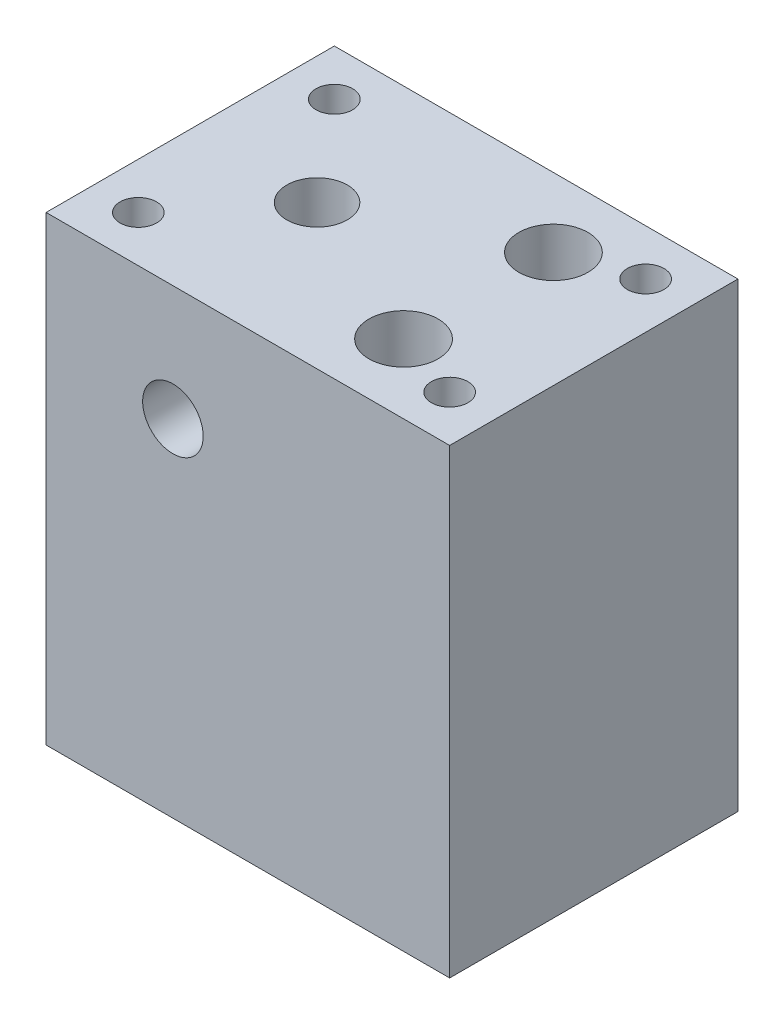
ISO-10303-21;
HEADER;
FILE_DESCRIPTION(('STEP AP214'),'2;1');
FILE_NAME('part.step','',(''),(''),'','','');
FILE_SCHEMA(('AUTOMOTIVE_DESIGN { 1 0 10303 214 1 1 1 1 }'));
ENDSEC;
DATA;
#1=APPLICATION_CONTEXT('core data for automotive mechanical design processes');
#2=APPLICATION_PROTOCOL_DEFINITION('international standard','automotive_design',2000,#1);
#3=PRODUCT_CONTEXT('',#1,'mechanical');
#4=PRODUCT('Part','Part','',(#3));
#5=PRODUCT_RELATED_PRODUCT_CATEGORY('part','',(#4));
#6=PRODUCT_DEFINITION_FORMATION('','',#4);
#7=PRODUCT_DEFINITION_CONTEXT('part definition',#1,'design');
#8=PRODUCT_DEFINITION('design','',#6,#7);
#9=PRODUCT_DEFINITION_SHAPE('','',#8);
#10=(LENGTH_UNIT() NAMED_UNIT(*) SI_UNIT(.MILLI.,.METRE.));
#11=(NAMED_UNIT(*) PLANE_ANGLE_UNIT() SI_UNIT($,.RADIAN.));
#12=(NAMED_UNIT(*) SI_UNIT($,.STERADIAN.) SOLID_ANGLE_UNIT());
#13=UNCERTAINTY_MEASURE_WITH_UNIT(LENGTH_MEASURE(1.E-05),#10,'distance_accuracy_value','');
#14=(GEOMETRIC_REPRESENTATION_CONTEXT(3) GLOBAL_UNCERTAINTY_ASSIGNED_CONTEXT((#13)) GLOBAL_UNIT_ASSIGNED_CONTEXT((#10,
#11,#12)) REPRESENTATION_CONTEXT('',''));
#15=CARTESIAN_POINT('',(0.,0.,0.));
#16=DIRECTION('',(0.,0.,1.));
#17=DIRECTION('',(1.,0.,0.));
#18=AXIS2_PLACEMENT_3D('',#15,#16,#17);
#19=CARTESIAN_POINT('',(0.,40.,0.));
#20=DIRECTION('',(1.,0.,0.));
#21=DIRECTION('',(0.,0.,-1.));
#22=AXIS2_PLACEMENT_3D('',#19,#20,#21);
#23=PLANE('',#22);
#24=DIRECTION('',(0.,0.,1.));
#25=VECTOR('',#24,1.);
#26=CARTESIAN_POINT('',(0.,0.,0.));
#27=LINE('',#26,#25);
#28=CARTESIAN_POINT('',(0.,0.,-25.));
#29=VERTEX_POINT('',#28);
#30=CARTESIAN_POINT('',(0.,0.,0.));
#31=VERTEX_POINT('',#30);
#32=EDGE_CURVE('E106',#29,#31,#27,.T.);
#33=ORIENTED_EDGE('',*,*,#32,.T.);
#34=DIRECTION('',(0.,-1.,0.));
#35=VECTOR('',#34,1.);
#36=CARTESIAN_POINT('',(0.,40.,0.));
#37=LINE('',#36,#35);
#38=CARTESIAN_POINT('',(0.,40.,0.));
#39=VERTEX_POINT('',#38);
#40=EDGE_CURVE('E87',#39,#31,#37,.T.);
#41=ORIENTED_EDGE('',*,*,#40,.F.);
#42=DIRECTION('',(0.,0.,1.));
#43=VECTOR('',#42,1.);
#44=CARTESIAN_POINT('',(0.,40.,0.));
#45=LINE('',#44,#43);
#46=CARTESIAN_POINT('',(0.,40.,-25.));
#47=VERTEX_POINT('',#46);
#48=EDGE_CURVE('E94',#47,#39,#45,.T.);
#49=ORIENTED_EDGE('',*,*,#48,.F.);
#50=DIRECTION('',(0.,-1.,0.));
#51=VECTOR('',#50,1.);
#52=CARTESIAN_POINT('',(0.,40.,-25.));
#53=LINE('',#52,#51);
#54=EDGE_CURVE('E219',#47,#29,#53,.T.);
#55=ORIENTED_EDGE('',*,*,#54,.T.);
#56=EDGE_LOOP('',(#33,#41,#49,#55));
#57=FACE_BOUND('',#56,.T.);
#58=ADVANCED_FACE('F37',(#57),#23,.F.);
#59=CARTESIAN_POINT('',(0.,40.,0.));
#60=DIRECTION('',(0.,0.,-1.));
#61=DIRECTION('',(-1.,0.,0.));
#62=AXIS2_PLACEMENT_3D('',#59,#60,#61);
#63=PLANE('',#62);
#64=CARTESIAN_POINT('',(11.,30.,0.));
#65=DIRECTION('',(0.,0.,1.));
#66=DIRECTION('',(1.,0.,0.));
#67=AXIS2_PLACEMENT_3D('',#64,#65,#66);
#68=CIRCLE('',#67,2.625);
#69=CARTESIAN_POINT('',(13.625,30.,0.));
#70=VERTEX_POINT('',#69);
#71=EDGE_CURVE('E121',#70,#70,#68,.T.);
#72=ORIENTED_EDGE('',*,*,#71,.F.);
#73=EDGE_LOOP('',(#72));
#74=FACE_BOUND('',#73,.T.);
#75=DIRECTION('',(1.,0.,0.));
#76=VECTOR('',#75,1.);
#77=CARTESIAN_POINT('',(0.,0.,0.));
#78=LINE('',#77,#76);
#79=CARTESIAN_POINT('',(35.,0.,0.));
#80=VERTEX_POINT('',#79);
#81=EDGE_CURVE('E221',#31,#80,#78,.T.);
#82=ORIENTED_EDGE('',*,*,#81,.T.);
#83=DIRECTION('',(0.,-1.,0.));
#84=VECTOR('',#83,1.);
#85=CARTESIAN_POINT('',(35.,40.,0.));
#86=LINE('',#85,#84);
#87=CARTESIAN_POINT('',(35.,40.,0.));
#88=VERTEX_POINT('',#87);
#89=EDGE_CURVE('E90',#88,#80,#86,.T.);
#90=ORIENTED_EDGE('',*,*,#89,.F.);
#91=DIRECTION('',(1.,0.,0.));
#92=VECTOR('',#91,1.);
#93=CARTESIAN_POINT('',(0.,40.,0.));
#94=LINE('',#93,#92);
#95=EDGE_CURVE('E83',#39,#88,#94,.T.);
#96=ORIENTED_EDGE('',*,*,#95,.F.);
#97=ORIENTED_EDGE('',*,*,#40,.T.);
#98=EDGE_LOOP('',(#82,#90,#96,#97));
#99=FACE_BOUND('',#98,.T.);
#100=ADVANCED_FACE('F85',(#74,#99),#63,.F.);
#101=CARTESIAN_POINT('',(35.,40.,0.));
#102=DIRECTION('',(-1.,0.,0.));
#103=DIRECTION('',(0.,0.,1.));
#104=AXIS2_PLACEMENT_3D('',#101,#102,#103);
#105=PLANE('',#104);
#106=DIRECTION('',(0.,0.,-1.));
#107=VECTOR('',#106,1.);
#108=CARTESIAN_POINT('',(35.,0.,0.));
#109=LINE('',#108,#107);
#110=CARTESIAN_POINT('',(35.,0.,-25.));
#111=VERTEX_POINT('',#110);
#112=EDGE_CURVE('E223',#80,#111,#109,.T.);
#113=ORIENTED_EDGE('',*,*,#112,.T.);
#114=DIRECTION('',(0.,-1.,0.));
#115=VECTOR('',#114,1.);
#116=CARTESIAN_POINT('',(35.,40.,-25.));
#117=LINE('',#116,#115);
#118=CARTESIAN_POINT('',(35.,40.,-25.));
#119=VERTEX_POINT('',#118);
#120=EDGE_CURVE('E110',#119,#111,#117,.T.);
#121=ORIENTED_EDGE('',*,*,#120,.F.);
#122=DIRECTION('',(0.,0.,-1.));
#123=VECTOR('',#122,1.);
#124=CARTESIAN_POINT('',(35.,40.,0.));
#125=LINE('',#124,#123);
#126=EDGE_CURVE('E93',#88,#119,#125,.T.);
#127=ORIENTED_EDGE('',*,*,#126,.F.);
#128=ORIENTED_EDGE('',*,*,#89,.T.);
#129=EDGE_LOOP('',(#113,#121,#127,#128));
#130=FACE_BOUND('',#129,.T.);
#131=ADVANCED_FACE('F163',(#130),#105,.F.);
#132=CARTESIAN_POINT('',(0.,40.,-25.));
#133=DIRECTION('',(0.,0.,1.));
#134=DIRECTION('',(1.,0.,0.));
#135=AXIS2_PLACEMENT_3D('',#132,#133,#134);
#136=PLANE('',#135);
#137=DIRECTION('',(-1.,0.,0.));
#138=VECTOR('',#137,1.);
#139=CARTESIAN_POINT('',(0.,0.,-25.));
#140=LINE('',#139,#138);
#141=EDGE_CURVE('E103',#111,#29,#140,.T.);
#142=ORIENTED_EDGE('',*,*,#141,.T.);
#143=ORIENTED_EDGE('',*,*,#54,.F.);
#144=DIRECTION('',(-1.,0.,0.));
#145=VECTOR('',#144,1.);
#146=CARTESIAN_POINT('',(0.,40.,-25.));
#147=LINE('',#146,#145);
#148=EDGE_CURVE('E99',#119,#47,#147,.T.);
#149=ORIENTED_EDGE('',*,*,#148,.F.);
#150=ORIENTED_EDGE('',*,*,#120,.T.);
#151=EDGE_LOOP('',(#142,#143,#149,#150));
#152=FACE_BOUND('',#151,.T.);
#153=ADVANCED_FACE('F169',(#152),#136,.F.);
#154=CARTESIAN_POINT('',(0.,40.,0.));
#155=DIRECTION('',(0.,-1.,0.));
#156=DIRECTION('',(0.,0.,-1.));
#157=AXIS2_PLACEMENT_3D('',#154,#155,#156);
#158=PLANE('',#157);
#159=CARTESIAN_POINT('',(11.,40.,-12.5));
#160=DIRECTION('',(0.,-1.,0.));
#161=DIRECTION('',(0.,0.,-1.));
#162=AXIS2_PLACEMENT_3D('',#159,#160,#161);
#163=CIRCLE('',#162,2.625);
#164=CARTESIAN_POINT('',(11.,40.,-15.125));
#165=VERTEX_POINT('',#164);
#166=EDGE_CURVE('E183',#165,#165,#163,.T.);
#167=ORIENTED_EDGE('',*,*,#166,.T.);
#168=EDGE_LOOP('',(#167));
#169=FACE_BOUND('',#168,.T.);
#170=CARTESIAN_POINT('',(4.,40.,-21.));
#171=DIRECTION('',(0.,1.,0.));
#172=DIRECTION('',(0.,0.,-1.));
#173=AXIS2_PLACEMENT_3D('',#170,#171,#172);
#174=CIRCLE('',#173,1.5875);
#175=CARTESIAN_POINT('',(4.,40.,-22.5875));
#176=VERTEX_POINT('',#175);
#177=EDGE_CURVE('E187',#176,#176,#174,.T.);
#178=ORIENTED_EDGE('',*,*,#177,.F.);
#179=EDGE_LOOP('',(#178));
#180=FACE_BOUND('',#179,.T.);
#181=CARTESIAN_POINT('',(31.,40.,-4.));
#182=DIRECTION('',(0.,1.,0.));
#183=DIRECTION('',(0.,0.,-1.));
#184=AXIS2_PLACEMENT_3D('',#181,#182,#183);
#185=CIRCLE('',#184,1.5875);
#186=CARTESIAN_POINT('',(31.,40.,-5.5875));
#187=VERTEX_POINT('',#186);
#188=EDGE_CURVE('E191',#187,#187,#185,.T.);
#189=ORIENTED_EDGE('',*,*,#188,.F.);
#190=EDGE_LOOP('',(#189));
#191=FACE_BOUND('',#190,.T.);
#192=CARTESIAN_POINT('',(31.,40.,-21.));
#193=DIRECTION('',(0.,1.,0.));
#194=DIRECTION('',(0.,0.,1.));
#195=AXIS2_PLACEMENT_3D('',#192,#193,#194);
#196=CIRCLE('',#195,1.5875);
#197=CARTESIAN_POINT('',(31.,40.,-19.4125));
#198=VERTEX_POINT('',#197);
#199=EDGE_CURVE('E195',#198,#198,#196,.T.);
#200=ORIENTED_EDGE('',*,*,#199,.F.);
#201=EDGE_LOOP('',(#200));
#202=FACE_BOUND('',#201,.T.);
#203=CARTESIAN_POINT('',(4.,40.,-4.));
#204=DIRECTION('',(0.,1.,0.));
#205=DIRECTION('',(0.,0.,1.));
#206=AXIS2_PLACEMENT_3D('',#203,#204,#205);
#207=CIRCLE('',#206,1.5875);
#208=CARTESIAN_POINT('',(4.,40.,-2.4125));
#209=VERTEX_POINT('',#208);
#210=EDGE_CURVE('E199',#209,#209,#207,.T.);
#211=ORIENTED_EDGE('',*,*,#210,.F.);
#212=EDGE_LOOP('',(#211));
#213=FACE_BOUND('',#212,.T.);
#214=CARTESIAN_POINT('',(25.,40.,-19.));
#215=DIRECTION('',(0.,1.,0.));
#216=DIRECTION('',(0.,0.,1.));
#217=AXIS2_PLACEMENT_3D('',#214,#215,#216);
#218=CIRCLE('',#217,2.99999999999999);
#219=CARTESIAN_POINT('',(25.,40.,-16.));
#220=VERTEX_POINT('',#219);
#221=EDGE_CURVE('E120',#220,#220,#218,.T.);
#222=ORIENTED_EDGE('',*,*,#221,.F.);
#223=EDGE_LOOP('',(#222));
#224=FACE_BOUND('',#223,.T.);
#225=CARTESIAN_POINT('',(25.,40.,-6.));
#226=DIRECTION('',(0.,-1.,0.));
#227=DIRECTION('',(0.,0.,-1.));
#228=AXIS2_PLACEMENT_3D('',#225,#226,#227);
#229=CIRCLE('',#228,2.99999999999999);
#230=CARTESIAN_POINT('',(25.,40.,-8.99999999999999));
#231=VERTEX_POINT('',#230);
#232=EDGE_CURVE('E205',#231,#231,#229,.T.);
#233=ORIENTED_EDGE('',*,*,#232,.T.);
#234=EDGE_LOOP('',(#233));
#235=FACE_BOUND('',#234,.T.);
#236=ORIENTED_EDGE('',*,*,#48,.T.);
#237=ORIENTED_EDGE('',*,*,#95,.T.);
#238=ORIENTED_EDGE('',*,*,#126,.T.);
#239=ORIENTED_EDGE('',*,*,#148,.T.);
#240=EDGE_LOOP('',(#236,#237,#238,#239));
#241=FACE_BOUND('',#240,.T.);
#242=ADVANCED_FACE('F97',(#169,#180,#191,#202,#213,#224,#235,#241),#158,.F.);
#243=CARTESIAN_POINT('',(0.,0.,0.));
#244=DIRECTION('',(0.,-1.,0.));
#245=DIRECTION('',(0.,0.,-1.));
#246=AXIS2_PLACEMENT_3D('',#243,#244,#245);
#247=PLANE('',#246);
#248=CARTESIAN_POINT('',(11.,0.,-12.5));
#249=DIRECTION('',(0.,1.,0.));
#250=DIRECTION('',(0.,0.,1.));
#251=AXIS2_PLACEMENT_3D('',#248,#249,#250);
#252=CIRCLE('',#251,5.5);
#253=CARTESIAN_POINT('',(11.,0.,-7.));
#254=VERTEX_POINT('',#253);
#255=EDGE_CURVE('E209',#254,#254,#252,.T.);
#256=ORIENTED_EDGE('',*,*,#255,.T.);
#257=EDGE_LOOP('',(#256));
#258=FACE_BOUND('',#257,.T.);
#259=ORIENTED_EDGE('',*,*,#32,.F.);
#260=ORIENTED_EDGE('',*,*,#141,.F.);
#261=ORIENTED_EDGE('',*,*,#112,.F.);
#262=ORIENTED_EDGE('',*,*,#81,.F.);
#263=EDGE_LOOP('',(#259,#260,#261,#262));
#264=FACE_BOUND('',#263,.T.);
#265=ADVANCED_FACE('F155',(#258,#264),#247,.T.);
#266=CARTESIAN_POINT('',(11.,35.,-12.5));
#267=DIRECTION('',(0.,-1.,0.));
#268=DIRECTION('',(0.,0.,-1.));
#269=AXIS2_PLACEMENT_3D('',#266,#267,#268);
#270=CYLINDRICAL_SURFACE('',#269,5.5);
#271=CARTESIAN_POINT('',(13.625,30.,-7.6668462677047));
#272=CARTESIAN_POINT('',(13.6249901282648,29.8622779116695,-7.66683479677179));
#273=CARTESIAN_POINT('',(13.6140896786244,29.7243557847855,-7.66087117184379));
#274=CARTESIAN_POINT('',(13.571005990129,29.4526720082657,-7.63785145158561));
#275=CARTESIAN_POINT('',(13.5387740456933,29.3189206150779,-7.62076997266221));
#276=CARTESIAN_POINT('',(13.4546845844008,29.0600083325892,-7.57793566493952));
#277=CARTESIAN_POINT('',(13.4029241854982,28.9348084959442,-7.55222581511403));
#278=CARTESIAN_POINT('',(13.281541431072,28.6948999848225,-7.495097063231));
#279=CARTESIAN_POINT('',(13.2119195297233,28.5801910436881,-7.46367830634313));
#280=CARTESIAN_POINT('',(13.0506750069265,28.355027237704,-7.39579283601655));
#281=CARTESIAN_POINT('',(12.9577963415563,28.2455322446542,-7.35912432681001));
#282=CARTESIAN_POINT('',(12.7552942482689,28.0429373054358,-7.28650663048745));
#283=CARTESIAN_POINT('',(12.6456631182662,27.9498449431179,-7.25055778288424));
#284=CARTESIAN_POINT('',(12.4047067226166,27.7772384284651,-7.18084276528552));
#285=CARTESIAN_POINT('',(12.2724737579157,27.6988761998155,-7.14733752274563));
#286=CARTESIAN_POINT('',(11.9948054037284,27.565942151493,-7.08885993056047));
#287=CARTESIAN_POINT('',(11.8493776810145,27.5113566220602,-7.06388266544304));
#288=CARTESIAN_POINT('',(11.5595926660669,27.4312322541903,-7.02672224843766));
#289=CARTESIAN_POINT('',(11.4157946859647,27.404018362084,-7.01380533554801));
#290=CARTESIAN_POINT('',(11.1251360814438,27.3739232376379,-6.99950298994396));
#291=CARTESIAN_POINT('',(10.9782771684988,27.3710287549441,-6.99811127776598));
#292=CARTESIAN_POINT('',(10.6981367434017,27.3889404588574,-7.00664341578106));
#293=CARTESIAN_POINT('',(10.5647031049453,27.4078828983346,-7.01567750691494));
#294=CARTESIAN_POINT('',(10.3031771170397,27.4656363585988,-7.04273646497911));
#295=CARTESIAN_POINT('',(10.1750851657206,27.5044488575017,-7.0607620007723));
#296=CARTESIAN_POINT('',(9.92555403788537,27.60117348318,-7.10445916200192));
#297=CARTESIAN_POINT('',(9.80423981708616,27.6593570914555,-7.13023893475351));
#298=CARTESIAN_POINT('',(9.57278861845472,27.7928390226434,-7.18706383148426));
#299=CARTESIAN_POINT('',(9.46265574705294,27.8681436006999,-7.21811087880672));
#300=CARTESIAN_POINT('',(9.24635212122785,28.0413787501465,-7.2857249621281));
#301=CARTESIAN_POINT('',(9.14138519784886,28.1407181708223,-7.32253733397194));
#302=CARTESIAN_POINT('',(8.94898474218536,28.3553850248951,-7.39569273856378));
#303=CARTESIAN_POINT('',(8.86156263524211,28.4707227944281,-7.43203545114799));
#304=CARTESIAN_POINT('',(8.70216431099405,28.7217799580985,-7.50220558694354));
#305=CARTESIAN_POINT('',(8.63127417798528,28.8582627042986,-7.53579196374088));
#306=CARTESIAN_POINT('',(8.5139924241775,29.1432219133188,-7.59346522916457));
#307=CARTESIAN_POINT('',(8.46757727493871,29.2916866985565,-7.61756123546969));
#308=CARTESIAN_POINT('',(8.40412412335123,29.5843935048764,-7.65101754774467));
#309=CARTESIAN_POINT('',(8.38511244934565,29.7280914121564,-7.66136310357726));
#310=CARTESIAN_POINT('',(8.37108130783224,30.0169652195578,-7.66896802592995));
#311=CARTESIAN_POINT('',(8.37604803970468,30.1621402215426,-7.66623491979914));
#312=CARTESIAN_POINT('',(8.4080221869395,30.4351523232109,-7.64903025989778));
#313=CARTESIAN_POINT('',(8.43288489340792,30.5633236263371,-7.63570173503128));
#314=CARTESIAN_POINT('',(8.50086150719932,30.8134750051585,-7.60043251030987));
#315=CARTESIAN_POINT('',(8.54398072907285,30.9354532664438,-7.57848930281906));
#316=CARTESIAN_POINT('',(8.64938753930454,31.1761403551567,-7.52725495122093));
#317=CARTESIAN_POINT('',(8.71247021956767,31.2944362946748,-7.49767062630001));
#318=CARTESIAN_POINT('',(8.85529644497713,31.5194236303392,-7.43479205536135));
#319=CARTESIAN_POINT('',(8.93504836180092,31.6261091543682,-7.40149594913687));
#320=CARTESIAN_POINT('',(9.11948154049399,31.8374133209798,-7.3304286147309));
#321=CARTESIAN_POINT('',(9.22595954628727,31.9404433850348,-7.29257601310726));
#322=CARTESIAN_POINT('',(9.45539128637085,32.1276111505145,-7.21997588420257));
#323=CARTESIAN_POINT('',(9.57834908219741,32.2117441809385,-7.18522912590414));
#324=CARTESIAN_POINT('',(9.84046103969172,32.3599038137956,-7.12190111508204));
#325=CARTESIAN_POINT('',(9.97986752897487,32.4235399994732,-7.09344249776267));
#326=CARTESIAN_POINT('',(10.2691506729018,32.5258602485318,-7.04681243829902));
#327=CARTESIAN_POINT('',(10.4190188540988,32.564564251694,-7.02863277687567));
#328=CARTESIAN_POINT('',(10.7110183004157,32.6128714249388,-7.0058150394812));
#329=CARTESIAN_POINT('',(10.852702668803,32.624695786954,-7.0001446281356));
#330=CARTESIAN_POINT('',(11.1361117889416,32.6252922980903,-6.99986105837891));
#331=CARTESIAN_POINT('',(11.2778365170112,32.6140711416984,-7.00524468888184));
#332=CARTESIAN_POINT('',(11.5489157325919,32.570429012824,-7.02586571967684));
#333=CARTESIAN_POINT('',(11.6785167482823,32.5392414635268,-7.04052928323239));
#334=CARTESIAN_POINT('',(11.9304832201053,32.4581197506355,-7.07778338867266));
#335=CARTESIAN_POINT('',(12.0528475416986,32.408182656535,-7.10037516968162));
#336=CARTESIAN_POINT('',(12.2929818191173,32.2885842806935,-7.15266645067618));
#337=CARTESIAN_POINT('',(12.4103005805975,32.2181398000291,-7.18263896088022));
#338=CARTESIAN_POINT('',(12.6319599237734,32.0605458676548,-7.24642678305868));
#339=CARTESIAN_POINT('',(12.7362945398904,31.9733887837066,-7.28024384786374));
#340=CARTESIAN_POINT('',(12.939032371559,31.7755608131869,-7.35191837574941));
#341=CARTESIAN_POINT('',(13.0360242921209,31.6634696135011,-7.38986283374461));
#342=CARTESIAN_POINT('',(13.2102505610795,31.4238674135965,-7.46276559046532));
#343=CARTESIAN_POINT('',(13.2874699286481,31.2963448287542,-7.49772161170037));
#344=CARTESIAN_POINT('',(13.4210044793948,31.0258897864398,-7.56093680679066));
#345=CARTESIAN_POINT('',(13.476900923225,30.882713387498,-7.5890582471738));
#346=CARTESIAN_POINT('',(13.5414772820211,30.6613909858433,-7.62235105552975));
#347=CARTESIAN_POINT('',(13.5597833443354,30.5865956618292,-7.6319623340338));
#348=CARTESIAN_POINT('',(13.5897896913013,30.4353620537801,-7.64785775270632));
#349=CARTESIAN_POINT('',(13.6014947386442,30.3589249957136,-7.65414429150004));
#350=CARTESIAN_POINT('',(13.6148602830449,30.2352589113207,-7.66134970459871));
#351=CARTESIAN_POINT('',(13.6186592752142,30.1883145520611,-7.66340652461958));
#352=CARTESIAN_POINT('',(13.6237308922018,30.0942546130649,-7.66615680656608));
#353=CARTESIAN_POINT('',(13.6250033788622,30.0471390241059,-7.66685019393462));
#354=CARTESIAN_POINT('',(13.625,30.,-7.6668462677047));
#355=B_SPLINE_CURVE_WITH_KNOTS('',3,(#271,#272,#273,#274,#275,#276,#277,#278,#279,#280,#281,
#282,#283,#284,#285,#286,#287,#288,#289,#290,#291,#292,#293,#294,#295,#296,#297,#298,#299,#300,
#301,#302,#303,#304,#305,#306,#307,#308,#309,#310,#311,#312,#313,#314,#315,#316,#317,#318,#319,
#320,#321,#322,#323,#324,#325,#326,#327,#328,#329,#330,#331,#332,#333,#334,#335,#336,#337,#338,
#339,#340,#341,#342,#343,#344,#345,#346,#347,#348,#349,#350,#351,#352,#353,#354),.UNSPECIFIED.,
.T.,.F.,(4,2,2,2,2,2,2,2,2,2,2,2,2,2,2,2,2,2,2,2,2,2,2,2,2,2,2,2,2,2,2,2,2,2,2,2,2,2,2,2,2,4),
(0.,0.412976658729747,0.826899523297015,1.23879045536823,1.65067091508384,2.09335745155009,
2.53624813263855,3.00574979692563,3.47498038476221,3.91333308681827,4.351446938279,
4.75477149894589,5.15812606692386,5.56738982394471,5.97680334638992,6.42228550182919,
6.86805682455853,7.33784753644795,7.80718579911947,8.24066280636813,8.67389035842104,
9.06584784464097,9.45791950991381,9.86814488855649,10.2785767890878,10.7352737502992,
11.1920834747106,11.6571402919379,12.1218247116843,12.5464473695193,12.9709466962708,
13.3714653472197,13.7720466242961,14.1905681918213,14.6092813450983,15.0662239662882,
15.5235117759771,15.9893667851179,16.2218671196698,16.4541994878217,16.5955439334091,
16.7368961079732),.UNSPECIFIED.);
#356=CARTESIAN_POINT('',(12.4332749154779,32.1991698471625,-7.19003549760799));
#357=VERTEX_POINT('',#356);
#358=CARTESIAN_POINT('',(9.56672508452237,32.1991698471611,-7.19003549760804));
#359=VERTEX_POINT('',#358);
#360=EDGE_CURVE('E114',#357,#359,#355,.T.);
#361=ORIENTED_EDGE('',*,*,#360,.F.);
#362=CARTESIAN_POINT('',(11.,32.1991698471611,-12.5));
#363=DIRECTION('',(0.,1.,0.));
#364=DIRECTION('',(0.,0.,1.));
#365=AXIS2_PLACEMENT_3D('',#362,#363,#364);
#366=CIRCLE('',#365,5.5);
#367=EDGE_CURVE('E107',#357,#359,#366,.T.);
#368=ORIENTED_EDGE('',*,*,#367,.T.);
#369=EDGE_LOOP('',(#361,#368));
#370=FACE_BOUND('',#369,.T.);
#371=ORIENTED_EDGE('',*,*,#255,.F.);
#372=EDGE_LOOP('',(#371));
#373=FACE_BOUND('',#372,.T.);
#374=ADVANCED_FACE('F122',(#370,#373),#270,.F.);
#375=CARTESIAN_POINT('',(25.,20.,-6.));
#376=DIRECTION('',(0.,1.,0.));
#377=DIRECTION('',(0.,0.,1.));
#378=AXIS2_PLACEMENT_3D('',#375,#376,#377);
#379=CYLINDRICAL_SURFACE('',#378,2.99999999999999);
#380=CARTESIAN_POINT('',(25.,20.,-6.));
#381=DIRECTION('',(0.,-1.,0.));
#382=DIRECTION('',(0.,0.,-1.));
#383=AXIS2_PLACEMENT_3D('',#380,#381,#382);
#384=CIRCLE('',#383,2.99999999999999);
#385=CARTESIAN_POINT('',(25.,20.,-8.99999999999999));
#386=VERTEX_POINT('',#385);
#387=EDGE_CURVE('E206',#386,#386,#384,.T.);
#388=ORIENTED_EDGE('',*,*,#387,.T.);
#389=EDGE_LOOP('',(#388));
#390=FACE_BOUND('',#389,.T.);
#391=ORIENTED_EDGE('',*,*,#232,.F.);
#392=EDGE_LOOP('',(#391));
#393=FACE_BOUND('',#392,.T.);
#394=ADVANCED_FACE('F148',(#390,#393),#379,.F.);
#395=CARTESIAN_POINT('',(25.,20.,-6.));
#396=DIRECTION('',(0.,-1.,0.));
#397=DIRECTION('',(0.,0.,-1.));
#398=AXIS2_PLACEMENT_3D('',#395,#396,#397);
#399=PLANE('',#398);
#400=ORIENTED_EDGE('',*,*,#387,.F.);
#401=EDGE_LOOP('',(#400));
#402=FACE_BOUND('',#401,.T.);
#403=ADVANCED_FACE('F145',(#402),#399,.F.);
#404=CARTESIAN_POINT('',(25.,5.,-19.));
#405=DIRECTION('',(0.,1.,0.));
#406=DIRECTION('',(0.,0.,1.));
#407=AXIS2_PLACEMENT_3D('',#404,#405,#406);
#408=CYLINDRICAL_SURFACE('',#407,2.99999999999999);
#409=CARTESIAN_POINT('',(25.,5.,-19.));
#410=DIRECTION('',(0.,1.,0.));
#411=DIRECTION('',(0.,0.,1.));
#412=AXIS2_PLACEMENT_3D('',#409,#410,#411);
#413=CIRCLE('',#412,2.99999999999999);
#414=CARTESIAN_POINT('',(25.,5.,-16.));
#415=VERTEX_POINT('',#414);
#416=EDGE_CURVE('E207',#415,#415,#413,.T.);
#417=ORIENTED_EDGE('',*,*,#416,.F.);
#418=EDGE_LOOP('',(#417));
#419=FACE_BOUND('',#418,.T.);
#420=ORIENTED_EDGE('',*,*,#221,.T.);
#421=EDGE_LOOP('',(#420));
#422=FACE_BOUND('',#421,.T.);
#423=ADVANCED_FACE('F141',(#419,#422),#408,.F.);
#424=CARTESIAN_POINT('',(25.,5.,-19.));
#425=DIRECTION('',(0.,1.,0.));
#426=DIRECTION('',(0.,0.,1.));
#427=AXIS2_PLACEMENT_3D('',#424,#425,#426);
#428=PLANE('',#427);
#429=ORIENTED_EDGE('',*,*,#416,.T.);
#430=EDGE_LOOP('',(#429));
#431=FACE_BOUND('',#430,.T.);
#432=ADVANCED_FACE('F132',(#431),#428,.T.);
#433=CARTESIAN_POINT('',(11.,30.,-10.));
#434=DIRECTION('',(0.,0.,1.));
#435=DIRECTION('',(1.,0.,0.));
#436=AXIS2_PLACEMENT_3D('',#433,#434,#435);
#437=CYLINDRICAL_SURFACE('',#436,2.625);
#438=ORIENTED_EDGE('',*,*,#360,.T.);
#439=CARTESIAN_POINT('',(9.5667250845224,32.1991698471611,-7.19003549760805));
#440=CARTESIAN_POINT('',(9.60961203366621,32.2271191917155,-7.2198102711319));
#441=CARTESIAN_POINT('',(9.65395310517183,32.2542296763907,-7.24825856040394));
#442=CARTESIAN_POINT('',(9.74551176590601,32.3064410045318,-7.30230869740427));
#443=CARTESIAN_POINT('',(9.79273137225139,32.3315404095669,-7.32790851275108));
#444=CARTESIAN_POINT('',(9.93869055801224,32.4033266565414,-7.40014555107032));
#445=CARTESIAN_POINT('',(10.0416201219669,32.4464279879189,-7.44214284325573));
#446=CARTESIAN_POINT('',(10.2567748112731,32.5201644488826,-7.51250632834878));
#447=CARTESIAN_POINT('',(10.3690370587823,32.5507466176002,-7.54081470148141));
#448=CARTESIAN_POINT('',(10.5990921253826,32.596849199163,-7.58299287103315));
#449=CARTESIAN_POINT('',(10.7168764405424,32.6123920222351,-7.59688415270365));
#450=CARTESIAN_POINT('',(10.9474480948292,32.6268700051399,-7.60982626897632));
#451=CARTESIAN_POINT('',(11.0601355026218,32.6267049460652,-7.60968113149897));
#452=CARTESIAN_POINT('',(11.2838313623468,32.6120150115849,-7.59654463015836));
#453=CARTESIAN_POINT('',(11.3948396350881,32.5974886144152,-7.58355190493167));
#454=CARTESIAN_POINT('',(11.610081326381,32.5554364795164,-7.54512730737122));
#455=CARTESIAN_POINT('',(11.7143978388738,32.5281359413465,-7.51991066750304));
#456=CARTESIAN_POINT('',(11.9156959355201,32.4623845010768,-7.45750678214166));
#457=CARTESIAN_POINT('',(12.0126757531514,32.4239309242651,-7.42031666494399));
#458=CARTESIAN_POINT('',(12.1636718616647,32.3538682618081,-7.35052337770679));
#459=CARTESIAN_POINT('',(12.2204721122222,32.324866800978,-7.32118243273575));
#460=CARTESIAN_POINT('',(12.329951474253,32.2640153677294,-7.25851585429637));
#461=CARTESIAN_POINT('',(12.3826422354014,32.2321740401339,-7.22520221630488));
#462=CARTESIAN_POINT('',(12.4332749154776,32.1991698471611,-7.19003549760805));
#463=B_SPLINE_CURVE_WITH_KNOTS('',3,(#439,#440,#441,#442,#443,#444,#445,#446,#447,#448,#449,
#450,#451,#452,#453,#454,#455,#456,#457,#458,#459,#460,#461,#462),.UNSPECIFIED.,.F.,.F.,(4,2,2,
2,2,2,2,2,2,2,2,4),(0.,0.1775910669711,0.355308043179256,0.711197772390281,1.06857786919412,
1.42542460772017,1.76184343602602,2.09829791595633,2.42903235452865,2.75984617521856,
2.97018005628933,3.17989419575507),.UNSPECIFIED.);
#464=EDGE_CURVE('E46',#359,#357,#463,.T.);
#465=ORIENTED_EDGE('',*,*,#464,.T.);
#466=EDGE_LOOP('',(#438,#465));
#467=FACE_BOUND('',#466,.T.);
#468=ORIENTED_EDGE('',*,*,#71,.T.);
#469=EDGE_LOOP('',(#468));
#470=FACE_BOUND('',#469,.T.);
#471=ADVANCED_FACE('F126',(#467,#470),#437,.F.);
#472=CARTESIAN_POINT('',(4.,33.65,-4.));
#473=DIRECTION('',(0.,1.,0.));
#474=DIRECTION('',(0.,0.,1.));
#475=AXIS2_PLACEMENT_3D('',#472,#473,#474);
#476=CYLINDRICAL_SURFACE('',#475,1.5875);
#477=CARTESIAN_POINT('',(4.,33.65,-4.));
#478=DIRECTION('',(0.,1.,0.));
#479=DIRECTION('',(0.,0.,1.));
#480=AXIS2_PLACEMENT_3D('',#477,#478,#479);
#481=CIRCLE('',#480,1.5875);
#482=CARTESIAN_POINT('',(4.,33.65,-2.4125));
#483=VERTEX_POINT('',#482);
#484=EDGE_CURVE('E236',#483,#483,#481,.T.);
#485=ORIENTED_EDGE('',*,*,#484,.F.);
#486=EDGE_LOOP('',(#485));
#487=FACE_BOUND('',#486,.T.);
#488=ORIENTED_EDGE('',*,*,#210,.T.);
#489=EDGE_LOOP('',(#488));
#490=FACE_BOUND('',#489,.T.);
#491=ADVANCED_FACE('F131',(#487,#490),#476,.F.);
#492=CARTESIAN_POINT('',(4.,33.65,-4.));
#493=DIRECTION('',(0.,1.,0.));
#494=DIRECTION('',(0.,0.,1.));
#495=AXIS2_PLACEMENT_3D('',#492,#493,#494);
#496=PLANE('',#495);
#497=ORIENTED_EDGE('',*,*,#484,.T.);
#498=EDGE_LOOP('',(#497));
#499=FACE_BOUND('',#498,.T.);
#500=ADVANCED_FACE('F259',(#499),#496,.T.);
#501=CARTESIAN_POINT('',(31.,33.65,-21.));
#502=DIRECTION('',(0.,1.,0.));
#503=DIRECTION('',(0.,0.,1.));
#504=AXIS2_PLACEMENT_3D('',#501,#502,#503);
#505=CYLINDRICAL_SURFACE('',#504,1.5875);
#506=CARTESIAN_POINT('',(31.,33.65,-21.));
#507=DIRECTION('',(0.,1.,0.));
#508=DIRECTION('',(0.,0.,1.));
#509=AXIS2_PLACEMENT_3D('',#506,#507,#508);
#510=CIRCLE('',#509,1.5875);
#511=CARTESIAN_POINT('',(31.,33.65,-19.4125));
#512=VERTEX_POINT('',#511);
#513=EDGE_CURVE('E243',#512,#512,#510,.T.);
#514=ORIENTED_EDGE('',*,*,#513,.F.);
#515=EDGE_LOOP('',(#514));
#516=FACE_BOUND('',#515,.T.);
#517=ORIENTED_EDGE('',*,*,#199,.T.);
#518=EDGE_LOOP('',(#517));
#519=FACE_BOUND('',#518,.T.);
#520=ADVANCED_FACE('F256',(#516,#519),#505,.F.);
#521=CARTESIAN_POINT('',(31.,33.65,-21.));
#522=DIRECTION('',(0.,1.,0.));
#523=DIRECTION('',(0.,0.,1.));
#524=AXIS2_PLACEMENT_3D('',#521,#522,#523);
#525=PLANE('',#524);
#526=ORIENTED_EDGE('',*,*,#513,.T.);
#527=EDGE_LOOP('',(#526));
#528=FACE_BOUND('',#527,.T.);
#529=ADVANCED_FACE('F254',(#528),#525,.T.);
#530=CARTESIAN_POINT('',(31.,33.65,-4.));
#531=DIRECTION('',(0.,1.,0.));
#532=DIRECTION('',(0.,0.,1.));
#533=AXIS2_PLACEMENT_3D('',#530,#531,#532);
#534=CYLINDRICAL_SURFACE('',#533,1.5875);
#535=CARTESIAN_POINT('',(31.,33.65,-4.));
#536=DIRECTION('',(0.,1.,0.));
#537=DIRECTION('',(0.,0.,-1.));
#538=AXIS2_PLACEMENT_3D('',#535,#536,#537);
#539=CIRCLE('',#538,1.5875);
#540=CARTESIAN_POINT('',(31.,33.65,-5.5875));
#541=VERTEX_POINT('',#540);
#542=EDGE_CURVE('E242',#541,#541,#539,.T.);
#543=ORIENTED_EDGE('',*,*,#542,.F.);
#544=EDGE_LOOP('',(#543));
#545=FACE_BOUND('',#544,.T.);
#546=ORIENTED_EDGE('',*,*,#188,.T.);
#547=EDGE_LOOP('',(#546));
#548=FACE_BOUND('',#547,.T.);
#549=ADVANCED_FACE('F265',(#545,#548),#534,.F.);
#550=CARTESIAN_POINT('',(31.,33.65,-4.));
#551=DIRECTION('',(0.,-1.,0.));
#552=DIRECTION('',(0.,0.,-1.));
#553=AXIS2_PLACEMENT_3D('',#550,#551,#552);
#554=PLANE('',#553);
#555=ORIENTED_EDGE('',*,*,#542,.T.);
#556=EDGE_LOOP('',(#555));
#557=FACE_BOUND('',#556,.T.);
#558=ADVANCED_FACE('F278',(#557),#554,.F.);
#559=CARTESIAN_POINT('',(4.,33.65,-21.));
#560=DIRECTION('',(0.,1.,0.));
#561=DIRECTION('',(0.,0.,1.));
#562=AXIS2_PLACEMENT_3D('',#559,#560,#561);
#563=CYLINDRICAL_SURFACE('',#562,1.5875);
#564=CARTESIAN_POINT('',(4.,33.65,-21.));
#565=DIRECTION('',(0.,1.,0.));
#566=DIRECTION('',(0.,0.,-1.));
#567=AXIS2_PLACEMENT_3D('',#564,#565,#566);
#568=CIRCLE('',#567,1.5875);
#569=CARTESIAN_POINT('',(4.,33.65,-22.5875));
#570=VERTEX_POINT('',#569);
#571=EDGE_CURVE('E238',#570,#570,#568,.T.);
#572=ORIENTED_EDGE('',*,*,#571,.F.);
#573=EDGE_LOOP('',(#572));
#574=FACE_BOUND('',#573,.T.);
#575=ORIENTED_EDGE('',*,*,#177,.T.);
#576=EDGE_LOOP('',(#575));
#577=FACE_BOUND('',#576,.T.);
#578=ADVANCED_FACE('F274',(#574,#577),#563,.F.);
#579=CARTESIAN_POINT('',(4.,33.65,-21.));
#580=DIRECTION('',(0.,-1.,0.));
#581=DIRECTION('',(0.,0.,-1.));
#582=AXIS2_PLACEMENT_3D('',#579,#580,#581);
#583=PLANE('',#582);
#584=ORIENTED_EDGE('',*,*,#571,.T.);
#585=EDGE_LOOP('',(#584));
#586=FACE_BOUND('',#585,.T.);
#587=ADVANCED_FACE('F270',(#586),#583,.F.);
#588=CARTESIAN_POINT('',(11.,40.,-12.5));
#589=DIRECTION('',(0.,-1.,0.));
#590=DIRECTION('',(0.,0.,-1.));
#591=AXIS2_PLACEMENT_3D('',#588,#589,#590);
#592=CYLINDRICAL_SURFACE('',#591,2.625);
#593=CARTESIAN_POINT('',(11.,34.2122665195141,-12.5));
#594=DIRECTION('',(0.,-1.,0.));
#595=DIRECTION('',(0.,0.,-1.));
#596=AXIS2_PLACEMENT_3D('',#593,#594,#595);
#597=CIRCLE('',#596,2.625);
#598=CARTESIAN_POINT('',(11.,34.2122665195141,-15.125));
#599=VERTEX_POINT('',#598);
#600=EDGE_CURVE('E12',#599,#599,#597,.T.);
#601=ORIENTED_EDGE('',*,*,#600,.T.);
#602=EDGE_LOOP('',(#601));
#603=FACE_BOUND('',#602,.T.);
#604=ORIENTED_EDGE('',*,*,#166,.F.);
#605=EDGE_LOOP('',(#604));
#606=FACE_BOUND('',#605,.T.);
#607=ADVANCED_FACE('F273',(#603,#606),#592,.F.);
#608=CARTESIAN_POINT('',(11.,32.1991698471611,-12.5));
#609=DIRECTION('',(0.,-1.,0.));
#610=DIRECTION('',(0.,0.,-1.));
#611=AXIS2_PLACEMENT_3D('',#608,#609,#610);
#612=CONICAL_SURFACE('',#611,5.5,0.959931088596875);
#613=ORIENTED_EDGE('',*,*,#600,.F.);
#614=EDGE_LOOP('',(#613));
#615=FACE_BOUND('',#614,.T.);
#616=ORIENTED_EDGE('',*,*,#464,.F.);
#617=ORIENTED_EDGE('',*,*,#367,.F.);
#618=EDGE_LOOP('',(#616,#617));
#619=FACE_BOUND('',#618,.T.);
#620=ADVANCED_FACE('F39',(#615,#619),#612,.F.);
#621=CLOSED_SHELL('',(#58,#100,#131,#153,#242,#265,#374,#394,#403,#423,#432,#471,#491,#500,#520,
#529,#549,#558,#578,#587,#607,#620));
#622=MANIFOLD_SOLID_BREP('B2',#621);
#623=ADVANCED_BREP_SHAPE_REPRESENTATION('',(#18,#622),#14);
#624=SHAPE_DEFINITION_REPRESENTATION(#9,#623);
ENDSEC;
END-ISO-10303-21;
